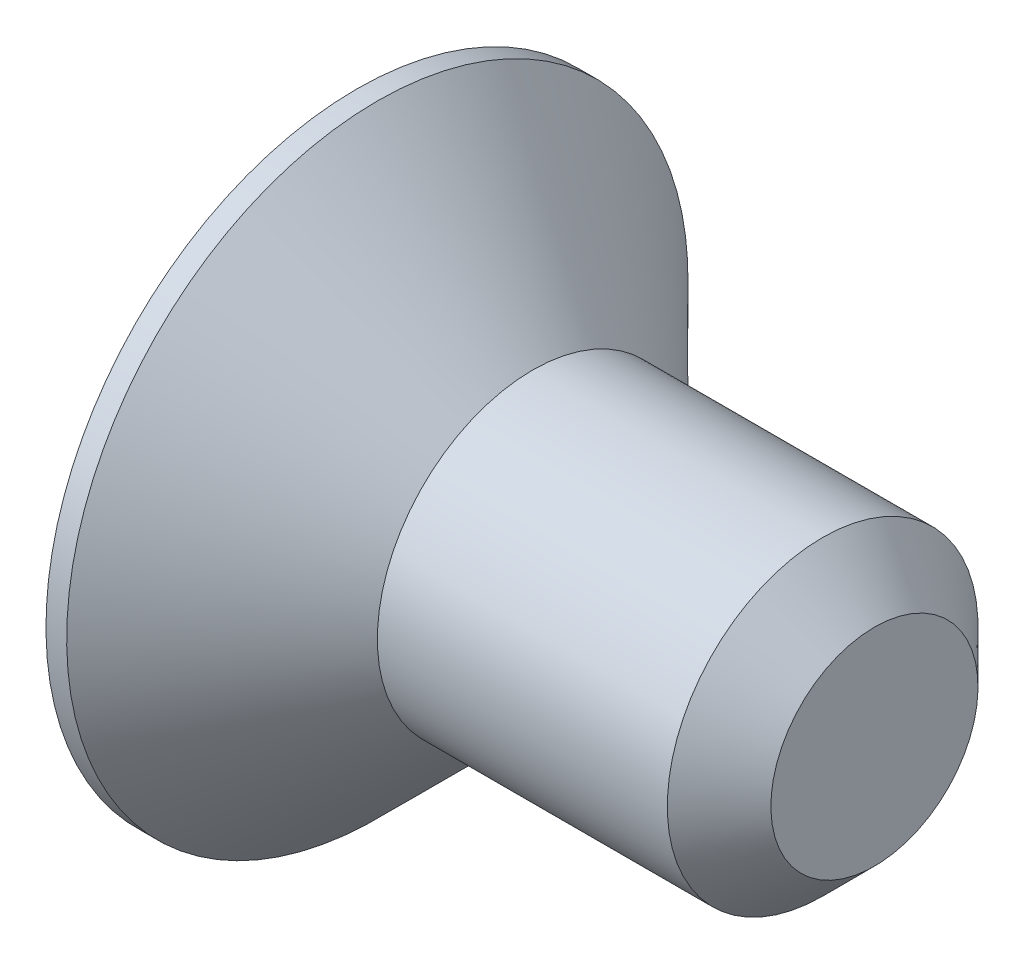
ISO-10303-21;
HEADER;
FILE_DESCRIPTION(('STEP AP214'),'2;1');
FILE_NAME('part.step','',(''),(''),'','','');
FILE_SCHEMA(('AUTOMOTIVE_DESIGN { 1 0 10303 214 1 1 1 1 }'));
ENDSEC;
DATA;
#1=APPLICATION_CONTEXT('core data for automotive mechanical design processes');
#2=APPLICATION_PROTOCOL_DEFINITION('international standard','automotive_design',2000,#1);
#3=PRODUCT_CONTEXT('',#1,'mechanical');
#4=PRODUCT('Part','Part','',(#3));
#5=PRODUCT_RELATED_PRODUCT_CATEGORY('part','',(#4));
#6=PRODUCT_DEFINITION_FORMATION('','',#4);
#7=PRODUCT_DEFINITION_CONTEXT('part definition',#1,'design');
#8=PRODUCT_DEFINITION('design','',#6,#7);
#9=PRODUCT_DEFINITION_SHAPE('','',#8);
#10=(LENGTH_UNIT() NAMED_UNIT(*) SI_UNIT(.MILLI.,.METRE.));
#11=(NAMED_UNIT(*) PLANE_ANGLE_UNIT() SI_UNIT($,.RADIAN.));
#12=(NAMED_UNIT(*) SI_UNIT($,.STERADIAN.) SOLID_ANGLE_UNIT());
#13=UNCERTAINTY_MEASURE_WITH_UNIT(LENGTH_MEASURE(1.E-05),#10,'distance_accuracy_value','');
#14=(GEOMETRIC_REPRESENTATION_CONTEXT(3) GLOBAL_UNCERTAINTY_ASSIGNED_CONTEXT((#13)) GLOBAL_UNIT_ASSIGNED_CONTEXT((#10,
#11,#12)) REPRESENTATION_CONTEXT('',''));
#15=CARTESIAN_POINT('',(0.,0.,0.));
#16=DIRECTION('',(0.,0.,1.));
#17=DIRECTION('',(1.,0.,0.));
#18=AXIS2_PLACEMENT_3D('',#15,#16,#17);
#19=CARTESIAN_POINT('',(0.,0.,0.));
#20=DIRECTION('',(-1.,0.,0.));
#21=DIRECTION('',(0.,-1.,0.));
#22=AXIS2_PLACEMENT_3D('',#19,#20,#21);
#23=PLANE('',#22);
#24=DIRECTION('',(0.,0.5,-0.866025403784438));
#25=VECTOR('',#24,1.);
#26=CARTESIAN_POINT('',(0.,0.577350269189626,1.));
#27=LINE('',#26,#25);
#28=CARTESIAN_POINT('',(0.,0.577350269189626,1.));
#29=VERTEX_POINT('',#28);
#30=CARTESIAN_POINT('',(0.,1.15470053837925,0.));
#31=VERTEX_POINT('',#30);
#32=EDGE_CURVE('E48',#29,#31,#27,.T.);
#33=ORIENTED_EDGE('',*,*,#32,.F.);
#34=DIRECTION('',(0.,1.,0.));
#35=VECTOR('',#34,1.);
#36=CARTESIAN_POINT('',(0.,-0.577350269189626,1.));
#37=LINE('',#36,#35);
#38=CARTESIAN_POINT('',(0.,-0.577350269189626,1.));
#39=VERTEX_POINT('',#38);
#40=EDGE_CURVE('E131',#39,#29,#37,.T.);
#41=ORIENTED_EDGE('',*,*,#40,.F.);
#42=DIRECTION('',(0.,0.5,0.866025403784439));
#43=VECTOR('',#42,1.);
#44=CARTESIAN_POINT('',(0.,-1.15470053837925,0.));
#45=LINE('',#44,#43);
#46=CARTESIAN_POINT('',(0.,-1.15470053837925,0.));
#47=VERTEX_POINT('',#46);
#48=EDGE_CURVE('E129',#47,#39,#45,.T.);
#49=ORIENTED_EDGE('',*,*,#48,.F.);
#50=DIRECTION('',(0.,-0.5,0.866025403784439));
#51=VECTOR('',#50,1.);
#52=CARTESIAN_POINT('',(0.,-0.577350269189625,-1.));
#53=LINE('',#52,#51);
#54=CARTESIAN_POINT('',(0.,-0.577350269189625,-1.));
#55=VERTEX_POINT('',#54);
#56=EDGE_CURVE('E96',#55,#47,#53,.T.);
#57=ORIENTED_EDGE('',*,*,#56,.F.);
#58=DIRECTION('',(0.,-1.,0.));
#59=VECTOR('',#58,1.);
#60=CARTESIAN_POINT('',(0.,0.577350269189626,-1.));
#61=LINE('',#60,#59);
#62=CARTESIAN_POINT('',(0.,0.577350269189626,-1.));
#63=VERTEX_POINT('',#62);
#64=EDGE_CURVE('E125',#63,#55,#61,.T.);
#65=ORIENTED_EDGE('',*,*,#64,.F.);
#66=DIRECTION('',(0.,-0.5,-0.866025403784439));
#67=VECTOR('',#66,1.);
#68=CARTESIAN_POINT('',(0.,1.15470053837925,0.));
#69=LINE('',#68,#67);
#70=EDGE_CURVE('E122',#31,#63,#69,.T.);
#71=ORIENTED_EDGE('',*,*,#70,.F.);
#72=EDGE_LOOP('',(#33,#41,#49,#57,#65,#71));
#73=FACE_BOUND('',#72,.T.);
#74=CARTESIAN_POINT('',(0.,0.,0.));
#75=DIRECTION('',(1.,0.,0.));
#76=DIRECTION('',(0.,1.,0.));
#77=AXIS2_PLACEMENT_3D('',#74,#75,#76);
#78=CIRCLE('',#77,3.);
#79=CARTESIAN_POINT('',(0.,3.,0.));
#80=VERTEX_POINT('',#79);
#81=EDGE_CURVE('E146',#80,#80,#78,.T.);
#82=ORIENTED_EDGE('',*,*,#81,.F.);
#83=EDGE_LOOP('',(#82));
#84=FACE_BOUND('',#83,.T.);
#85=ADVANCED_FACE('F33',(#73,#84),#23,.T.);
#86=CARTESIAN_POINT('',(5.,0.,0.));
#87=DIRECTION('',(1.,0.,0.));
#88=DIRECTION('',(0.,1.,0.));
#89=AXIS2_PLACEMENT_3D('',#86,#87,#88);
#90=CYLINDRICAL_SURFACE('',#89,3.);
#91=ORIENTED_EDGE('',*,*,#81,.T.);
#92=EDGE_LOOP('',(#91));
#93=FACE_BOUND('',#92,.T.);
#94=CARTESIAN_POINT('',(0.199999999999964,0.,0.));
#95=DIRECTION('',(1.,0.,0.));
#96=DIRECTION('',(0.,1.,0.));
#97=AXIS2_PLACEMENT_3D('',#94,#95,#96);
#98=CIRCLE('',#97,3.);
#99=CARTESIAN_POINT('',(0.199999999999964,3.,0.));
#100=VERTEX_POINT('',#99);
#101=EDGE_CURVE('E143',#100,#100,#98,.T.);
#102=ORIENTED_EDGE('',*,*,#101,.F.);
#103=EDGE_LOOP('',(#102));
#104=FACE_BOUND('',#103,.T.);
#105=ADVANCED_FACE('F166',(#93,#104),#90,.T.);
#106=CARTESIAN_POINT('',(1.7,0.,0.));
#107=DIRECTION('',(-1.,0.,0.));
#108=DIRECTION('',(0.,-1.,0.));
#109=AXIS2_PLACEMENT_3D('',#106,#107,#108);
#110=CONICAL_SURFACE('',#109,1.5,0.785398163397437);
#111=ORIENTED_EDGE('',*,*,#101,.T.);
#112=EDGE_LOOP('',(#111));
#113=FACE_BOUND('',#112,.T.);
#114=CARTESIAN_POINT('',(1.7,0.,0.));
#115=DIRECTION('',(1.,0.,0.));
#116=DIRECTION('',(0.,1.,0.));
#117=AXIS2_PLACEMENT_3D('',#114,#115,#116);
#118=CIRCLE('',#117,1.5);
#119=CARTESIAN_POINT('',(1.7,1.5,0.));
#120=VERTEX_POINT('',#119);
#121=EDGE_CURVE('E135',#120,#120,#118,.T.);
#122=ORIENTED_EDGE('',*,*,#121,.F.);
#123=EDGE_LOOP('',(#122));
#124=FACE_BOUND('',#123,.T.);
#125=ADVANCED_FACE('F171',(#113,#124),#110,.T.);
#126=CARTESIAN_POINT('',(5.,0.,0.));
#127=DIRECTION('',(1.,0.,0.));
#128=DIRECTION('',(0.,1.,0.));
#129=AXIS2_PLACEMENT_3D('',#126,#127,#128);
#130=CYLINDRICAL_SURFACE('',#129,1.5);
#131=CARTESIAN_POINT('',(4.5,0.,0.));
#132=DIRECTION('',(1.,0.,0.));
#133=DIRECTION('',(0.,1.,0.));
#134=AXIS2_PLACEMENT_3D('',#131,#132,#133);
#135=CIRCLE('',#134,1.5);
#136=CARTESIAN_POINT('',(4.5,1.5,0.));
#137=VERTEX_POINT('',#136);
#138=EDGE_CURVE('E11',#137,#137,#135,.F.);
#139=ORIENTED_EDGE('',*,*,#138,.T.);
#140=EDGE_LOOP('',(#139));
#141=FACE_BOUND('',#140,.T.);
#142=ORIENTED_EDGE('',*,*,#121,.T.);
#143=EDGE_LOOP('',(#142));
#144=FACE_BOUND('',#143,.T.);
#145=ADVANCED_FACE('F162',(#141,#144),#130,.T.);
#146=CARTESIAN_POINT('',(5.,1.5,0.));
#147=DIRECTION('',(1.,0.,0.));
#148=DIRECTION('',(0.,1.,0.));
#149=AXIS2_PLACEMENT_3D('',#146,#147,#148);
#150=PLANE('',#149);
#151=CARTESIAN_POINT('',(5.,0.,0.));
#152=DIRECTION('',(1.,0.,0.));
#153=DIRECTION('',(0.,1.,0.));
#154=AXIS2_PLACEMENT_3D('',#151,#152,#153);
#155=CIRCLE('',#154,1.);
#156=CARTESIAN_POINT('',(5.,1.,0.));
#157=VERTEX_POINT('',#156);
#158=EDGE_CURVE('E41',#157,#157,#155,.T.);
#159=ORIENTED_EDGE('',*,*,#158,.T.);
#160=EDGE_LOOP('',(#159));
#161=FACE_BOUND('',#160,.T.);
#162=ADVANCED_FACE('F151',(#161),#150,.T.);
#163=CARTESIAN_POINT('',(5.,0.,0.));
#164=DIRECTION('',(-1.,0.,0.));
#165=DIRECTION('',(0.,-1.,0.));
#166=AXIS2_PLACEMENT_3D('',#163,#164,#165);
#167=CONICAL_SURFACE('',#166,1.,0.785398163397446);
#168=ORIENTED_EDGE('',*,*,#138,.F.);
#169=EDGE_LOOP('',(#168));
#170=FACE_BOUND('',#169,.T.);
#171=ORIENTED_EDGE('',*,*,#158,.F.);
#172=EDGE_LOOP('',(#171));
#173=FACE_BOUND('',#172,.T.);
#174=ADVANCED_FACE('F35',(#170,#173),#167,.T.);
#175=CARTESIAN_POINT('',(1.2,0.577350269189626,1.));
#176=DIRECTION('',(0.,0.866025403784439,0.5));
#177=DIRECTION('',(0.,-0.5,0.866025403784439));
#178=AXIS2_PLACEMENT_3D('',#175,#176,#177);
#179=PLANE('',#178);
#180=ORIENTED_EDGE('',*,*,#32,.T.);
#181=DIRECTION('',(-1.,0.,0.));
#182=VECTOR('',#181,1.);
#183=CARTESIAN_POINT('',(1.2,1.15470053837925,0.));
#184=LINE('',#183,#182);
#185=CARTESIAN_POINT('',(1.2,1.15470053837925,0.));
#186=VERTEX_POINT('',#185);
#187=EDGE_CURVE('E78',#186,#31,#184,.T.);
#188=ORIENTED_EDGE('',*,*,#187,.F.);
#189=DIRECTION('',(0.,0.5,-0.866025403784438));
#190=VECTOR('',#189,1.);
#191=CARTESIAN_POINT('',(1.2,0.577350269189626,1.));
#192=LINE('',#191,#190);
#193=CARTESIAN_POINT('',(1.2,0.577350269189626,1.));
#194=VERTEX_POINT('',#193);
#195=EDGE_CURVE('E133',#194,#186,#192,.T.);
#196=ORIENTED_EDGE('',*,*,#195,.F.);
#197=DIRECTION('',(-1.,0.,0.));
#198=VECTOR('',#197,1.);
#199=CARTESIAN_POINT('',(1.2,0.577350269189626,1.));
#200=LINE('',#199,#198);
#201=EDGE_CURVE('E56',#194,#29,#200,.T.);
#202=ORIENTED_EDGE('',*,*,#201,.T.);
#203=EDGE_LOOP('',(#180,#188,#196,#202));
#204=FACE_BOUND('',#203,.T.);
#205=ADVANCED_FACE('F154',(#204),#179,.F.);
#206=CARTESIAN_POINT('',(1.2,-0.577350269189627,1.));
#207=DIRECTION('',(0.,0.,1.));
#208=DIRECTION('',(0.,-1.,0.));
#209=AXIS2_PLACEMENT_3D('',#206,#207,#208);
#210=PLANE('',#209);
#211=ORIENTED_EDGE('',*,*,#40,.T.);
#212=ORIENTED_EDGE('',*,*,#201,.F.);
#213=DIRECTION('',(0.,1.,0.));
#214=VECTOR('',#213,1.);
#215=CARTESIAN_POINT('',(1.2,-0.577350269189627,1.));
#216=LINE('',#215,#214);
#217=CARTESIAN_POINT('',(1.2,-0.577350269189627,1.));
#218=VERTEX_POINT('',#217);
#219=EDGE_CURVE('E108',#218,#194,#216,.T.);
#220=ORIENTED_EDGE('',*,*,#219,.F.);
#221=DIRECTION('',(-1.,0.,0.));
#222=VECTOR('',#221,1.);
#223=CARTESIAN_POINT('',(1.2,-0.577350269189627,1.));
#224=LINE('',#223,#222);
#225=EDGE_CURVE('E100',#218,#39,#224,.T.);
#226=ORIENTED_EDGE('',*,*,#225,.T.);
#227=EDGE_LOOP('',(#211,#212,#220,#226));
#228=FACE_BOUND('',#227,.T.);
#229=ADVANCED_FACE('F160',(#228),#210,.F.);
#230=CARTESIAN_POINT('',(1.2,-1.15470053837925,0.));
#231=DIRECTION('',(0.,-0.866025403784439,0.5));
#232=DIRECTION('',(0.,-0.5,-0.866025403784439));
#233=AXIS2_PLACEMENT_3D('',#230,#231,#232);
#234=PLANE('',#233);
#235=ORIENTED_EDGE('',*,*,#48,.T.);
#236=ORIENTED_EDGE('',*,*,#225,.F.);
#237=DIRECTION('',(0.,0.5,0.866025403784439));
#238=VECTOR('',#237,1.);
#239=CARTESIAN_POINT('',(1.2,-1.15470053837925,0.));
#240=LINE('',#239,#238);
#241=CARTESIAN_POINT('',(1.2,-1.15470053837925,0.));
#242=VERTEX_POINT('',#241);
#243=EDGE_CURVE('E104',#242,#218,#240,.T.);
#244=ORIENTED_EDGE('',*,*,#243,.F.);
#245=DIRECTION('',(-1.,0.,0.));
#246=VECTOR('',#245,1.);
#247=CARTESIAN_POINT('',(1.2,-1.15470053837925,0.));
#248=LINE('',#247,#246);
#249=EDGE_CURVE('E89',#242,#47,#248,.T.);
#250=ORIENTED_EDGE('',*,*,#249,.T.);
#251=EDGE_LOOP('',(#235,#236,#244,#250));
#252=FACE_BOUND('',#251,.T.);
#253=ADVANCED_FACE('F105',(#252),#234,.F.);
#254=CARTESIAN_POINT('',(1.2,-0.577350269189626,-1.));
#255=DIRECTION('',(0.,-0.866025403784439,-0.5));
#256=DIRECTION('',(0.,0.5,-0.866025403784439));
#257=AXIS2_PLACEMENT_3D('',#254,#255,#256);
#258=PLANE('',#257);
#259=ORIENTED_EDGE('',*,*,#56,.T.);
#260=ORIENTED_EDGE('',*,*,#249,.F.);
#261=DIRECTION('',(0.,-0.5,0.866025403784439));
#262=VECTOR('',#261,1.);
#263=CARTESIAN_POINT('',(1.2,-0.577350269189626,-1.));
#264=LINE('',#263,#262);
#265=CARTESIAN_POINT('',(1.2,-0.577350269189626,-1.));
#266=VERTEX_POINT('',#265);
#267=EDGE_CURVE('E93',#266,#242,#264,.T.);
#268=ORIENTED_EDGE('',*,*,#267,.F.);
#269=DIRECTION('',(-1.,0.,0.));
#270=VECTOR('',#269,1.);
#271=CARTESIAN_POINT('',(1.2,-0.577350269189626,-1.));
#272=LINE('',#271,#270);
#273=EDGE_CURVE('E101',#266,#55,#272,.T.);
#274=ORIENTED_EDGE('',*,*,#273,.T.);
#275=EDGE_LOOP('',(#259,#260,#268,#274));
#276=FACE_BOUND('',#275,.T.);
#277=ADVANCED_FACE('F91',(#276),#258,.F.);
#278=CARTESIAN_POINT('',(1.2,0.577350269189626,-1.));
#279=DIRECTION('',(0.,0.,-1.));
#280=DIRECTION('',(-1.,0.,0.));
#281=AXIS2_PLACEMENT_3D('',#278,#279,#280);
#282=PLANE('',#281);
#283=ORIENTED_EDGE('',*,*,#64,.T.);
#284=ORIENTED_EDGE('',*,*,#273,.F.);
#285=DIRECTION('',(0.,-1.,0.));
#286=VECTOR('',#285,1.);
#287=CARTESIAN_POINT('',(1.2,0.577350269189626,-1.));
#288=LINE('',#287,#286);
#289=CARTESIAN_POINT('',(1.2,0.577350269189626,-1.));
#290=VERTEX_POINT('',#289);
#291=EDGE_CURVE('E114',#290,#266,#288,.T.);
#292=ORIENTED_EDGE('',*,*,#291,.F.);
#293=DIRECTION('',(-1.,0.,0.));
#294=VECTOR('',#293,1.);
#295=CARTESIAN_POINT('',(1.2,0.577350269189626,-1.));
#296=LINE('',#295,#294);
#297=EDGE_CURVE('E138',#290,#63,#296,.T.);
#298=ORIENTED_EDGE('',*,*,#297,.T.);
#299=EDGE_LOOP('',(#283,#284,#292,#298));
#300=FACE_BOUND('',#299,.T.);
#301=ADVANCED_FACE('F185',(#300),#282,.F.);
#302=CARTESIAN_POINT('',(1.2,1.15470053837925,0.));
#303=DIRECTION('',(0.,0.866025403784439,-0.5));
#304=DIRECTION('',(0.,0.5,0.866025403784439));
#305=AXIS2_PLACEMENT_3D('',#302,#303,#304);
#306=PLANE('',#305);
#307=ORIENTED_EDGE('',*,*,#70,.T.);
#308=ORIENTED_EDGE('',*,*,#297,.F.);
#309=DIRECTION('',(0.,-0.5,-0.866025403784439));
#310=VECTOR('',#309,1.);
#311=CARTESIAN_POINT('',(1.2,1.15470053837925,0.));
#312=LINE('',#311,#310);
#313=EDGE_CURVE('E116',#186,#290,#312,.T.);
#314=ORIENTED_EDGE('',*,*,#313,.F.);
#315=ORIENTED_EDGE('',*,*,#187,.T.);
#316=EDGE_LOOP('',(#307,#308,#314,#315));
#317=FACE_BOUND('',#316,.T.);
#318=ADVANCED_FACE('F182',(#317),#306,.F.);
#319=CARTESIAN_POINT('',(1.2,0.,0.));
#320=DIRECTION('',(-1.,0.,0.));
#321=DIRECTION('',(0.,-1.,0.));
#322=AXIS2_PLACEMENT_3D('',#319,#320,#321);
#323=PLANE('',#322);
#324=ORIENTED_EDGE('',*,*,#195,.T.);
#325=ORIENTED_EDGE('',*,*,#313,.T.);
#326=ORIENTED_EDGE('',*,*,#291,.T.);
#327=ORIENTED_EDGE('',*,*,#267,.T.);
#328=ORIENTED_EDGE('',*,*,#243,.T.);
#329=ORIENTED_EDGE('',*,*,#219,.T.);
#330=EDGE_LOOP('',(#324,#325,#326,#327,#328,#329));
#331=FACE_BOUND('',#330,.T.);
#332=ADVANCED_FACE('F111',(#331),#323,.T.);
#333=CLOSED_SHELL('',(#85,#105,#125,#145,#162,#174,#205,#229,#253,#277,#301,#318,#332));
#334=MANIFOLD_SOLID_BREP('B2',#333);
#335=ADVANCED_BREP_SHAPE_REPRESENTATION('',(#18,#334),#14);
#336=SHAPE_DEFINITION_REPRESENTATION(#9,#335);
ENDSEC;
END-ISO-10303-21;
